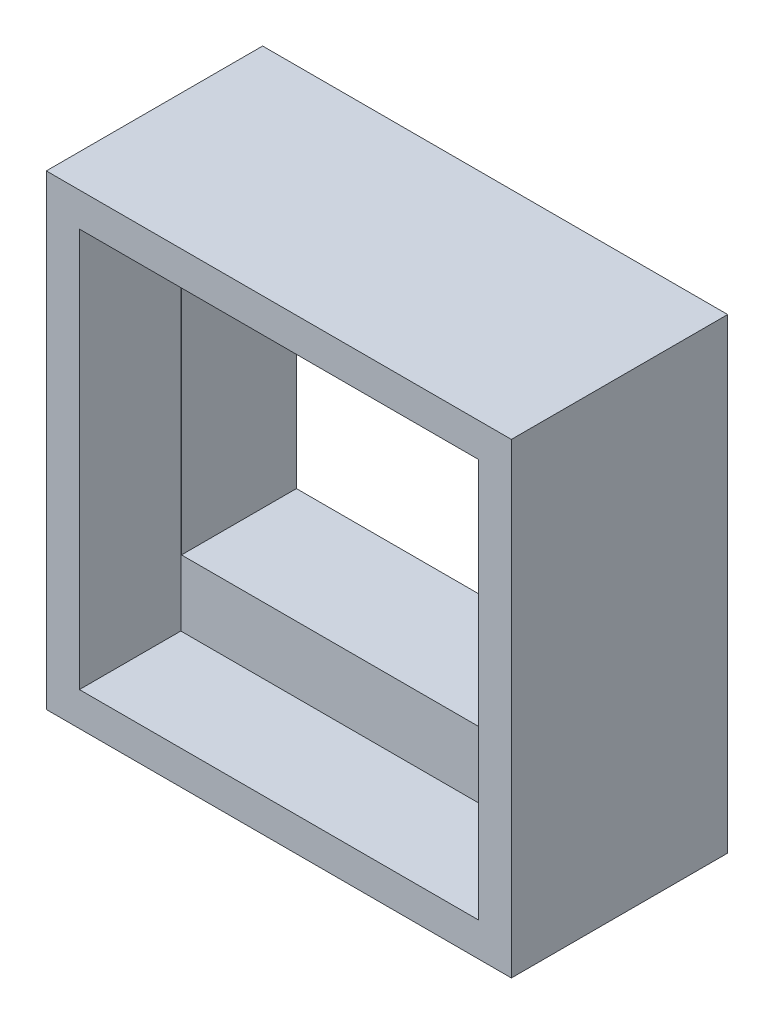
ISO-10303-21;
HEADER;
FILE_DESCRIPTION(('STEP AP214'),'2;1');
FILE_NAME('part.step','',(''),(''),'','','');
FILE_SCHEMA(('AUTOMOTIVE_DESIGN { 1 0 10303 214 1 1 1 1 }'));
ENDSEC;
DATA;
#1=APPLICATION_CONTEXT('core data for automotive mechanical design processes');
#2=APPLICATION_PROTOCOL_DEFINITION('international standard','automotive_design',2000,#1);
#3=PRODUCT_CONTEXT('',#1,'mechanical');
#4=PRODUCT('Part','Part','',(#3));
#5=PRODUCT_RELATED_PRODUCT_CATEGORY('part','',(#4));
#6=PRODUCT_DEFINITION_FORMATION('','',#4);
#7=PRODUCT_DEFINITION_CONTEXT('part definition',#1,'design');
#8=PRODUCT_DEFINITION('design','',#6,#7);
#9=PRODUCT_DEFINITION_SHAPE('','',#8);
#10=(LENGTH_UNIT() NAMED_UNIT(*) SI_UNIT(.MILLI.,.METRE.));
#11=(NAMED_UNIT(*) PLANE_ANGLE_UNIT() SI_UNIT($,.RADIAN.));
#12=(NAMED_UNIT(*) SI_UNIT($,.STERADIAN.) SOLID_ANGLE_UNIT());
#13=UNCERTAINTY_MEASURE_WITH_UNIT(LENGTH_MEASURE(1.E-05),#10,'distance_accuracy_value','');
#14=(GEOMETRIC_REPRESENTATION_CONTEXT(3) GLOBAL_UNCERTAINTY_ASSIGNED_CONTEXT((#13)) GLOBAL_UNIT_ASSIGNED_CONTEXT((#10,
#11,#12)) REPRESENTATION_CONTEXT('',''));
#15=CARTESIAN_POINT('',(0.,0.,0.));
#16=DIRECTION('',(0.,0.,1.));
#17=DIRECTION('',(1.,0.,0.));
#18=AXIS2_PLACEMENT_3D('',#15,#16,#17);
#19=CARTESIAN_POINT('',(-28.2393252100415,17.7130149812734,32.));
#20=DIRECTION('',(1.,0.,0.));
#21=DIRECTION('',(0.,1.,0.));
#22=AXIS2_PLACEMENT_3D('',#19,#20,#21);
#23=PLANE('',#22);
#24=DIRECTION('',(0.,0.,-1.));
#25=VECTOR('',#24,1.);
#26=CARTESIAN_POINT('',(-28.2393252100415,17.7130149812734,32.));
#27=LINE('',#26,#25);
#28=CARTESIAN_POINT('',(-28.2393252100415,17.7130149812734,17.));
#29=VERTEX_POINT('',#28);
#30=CARTESIAN_POINT('',(-28.2393252100415,17.7130149812734,0.));
#31=VERTEX_POINT('',#30);
#32=EDGE_CURVE('E204',#29,#31,#27,.T.);
#33=ORIENTED_EDGE('',*,*,#32,.F.);
#34=DIRECTION('',(0.,-1.,0.));
#35=VECTOR('',#34,1.);
#36=CARTESIAN_POINT('',(-28.2393252100415,17.7130149812734,17.));
#37=LINE('',#36,#35);
#38=CARTESIAN_POINT('',(-28.2393252100415,-21.6869850187266,17.));
#39=VERTEX_POINT('',#38);
#40=EDGE_CURVE('E63',#29,#39,#37,.T.);
#41=ORIENTED_EDGE('',*,*,#40,.T.);
#42=DIRECTION('',(0.,0.,-1.));
#43=VECTOR('',#42,1.);
#44=CARTESIAN_POINT('',(-28.2393252100415,-21.6869850187266,32.));
#45=LINE('',#44,#43);
#46=CARTESIAN_POINT('',(-28.2393252100415,-21.6869850187266,0.));
#47=VERTEX_POINT('',#46);
#48=EDGE_CURVE('E213',#39,#47,#45,.T.);
#49=ORIENTED_EDGE('',*,*,#48,.T.);
#50=DIRECTION('',(0.,-1.,0.));
#51=VECTOR('',#50,1.);
#52=CARTESIAN_POINT('',(-28.2393252100415,17.7130149812734,0.));
#53=LINE('',#52,#51);
#54=EDGE_CURVE('E188',#31,#47,#53,.T.);
#55=ORIENTED_EDGE('',*,*,#54,.F.);
#56=EDGE_LOOP('',(#33,#41,#49,#55));
#57=FACE_BOUND('',#56,.T.);
#58=ADVANCED_FACE('F39',(#57),#23,.T.);
#59=CARTESIAN_POINT('',(-28.2393252100415,-21.6869850187266,32.));
#60=DIRECTION('',(0.,1.,0.));
#61=DIRECTION('',(0.,0.,1.));
#62=AXIS2_PLACEMENT_3D('',#59,#60,#61);
#63=PLANE('',#62);
#64=ORIENTED_EDGE('',*,*,#48,.F.);
#65=DIRECTION('',(1.,0.,0.));
#66=VECTOR('',#65,1.);
#67=CARTESIAN_POINT('',(-28.2393252100415,-21.6869850187266,17.));
#68=LINE('',#67,#66);
#69=CARTESIAN_POINT('',(30.5606747899585,-21.6869850187266,17.));
#70=VERTEX_POINT('',#69);
#71=EDGE_CURVE('E182',#39,#70,#68,.T.);
#72=ORIENTED_EDGE('',*,*,#71,.T.);
#73=DIRECTION('',(0.,0.,-1.));
#74=VECTOR('',#73,1.);
#75=CARTESIAN_POINT('',(30.5606747899585,-21.6869850187266,32.));
#76=LINE('',#75,#74);
#77=CARTESIAN_POINT('',(30.5606747899585,-21.6869850187266,0.));
#78=VERTEX_POINT('',#77);
#79=EDGE_CURVE('E210',#70,#78,#76,.T.);
#80=ORIENTED_EDGE('',*,*,#79,.T.);
#81=DIRECTION('',(1.,0.,0.));
#82=VECTOR('',#81,1.);
#83=CARTESIAN_POINT('',(-28.2393252100415,-21.6869850187266,0.));
#84=LINE('',#83,#82);
#85=EDGE_CURVE('E192',#47,#78,#84,.T.);
#86=ORIENTED_EDGE('',*,*,#85,.F.);
#87=EDGE_LOOP('',(#64,#72,#80,#86));
#88=FACE_BOUND('',#87,.T.);
#89=ADVANCED_FACE('F291',(#88),#63,.T.);
#90=CARTESIAN_POINT('',(30.5606747899585,17.7130149812734,32.));
#91=DIRECTION('',(-1.,0.,0.));
#92=DIRECTION('',(0.,-1.,0.));
#93=AXIS2_PLACEMENT_3D('',#90,#91,#92);
#94=PLANE('',#93);
#95=ORIENTED_EDGE('',*,*,#79,.F.);
#96=DIRECTION('',(0.,1.,0.));
#97=VECTOR('',#96,1.);
#98=CARTESIAN_POINT('',(30.5606747899585,17.7130149812734,17.));
#99=LINE('',#98,#97);
#100=CARTESIAN_POINT('',(30.5606747899585,17.7130149812734,17.));
#101=VERTEX_POINT('',#100);
#102=EDGE_CURVE('E173',#70,#101,#99,.T.);
#103=ORIENTED_EDGE('',*,*,#102,.T.);
#104=DIRECTION('',(0.,0.,-1.));
#105=VECTOR('',#104,1.);
#106=CARTESIAN_POINT('',(30.5606747899585,17.7130149812734,32.));
#107=LINE('',#106,#105);
#108=CARTESIAN_POINT('',(30.5606747899585,17.7130149812734,0.));
#109=VERTEX_POINT('',#108);
#110=EDGE_CURVE('E207',#101,#109,#107,.T.);
#111=ORIENTED_EDGE('',*,*,#110,.T.);
#112=DIRECTION('',(0.,1.,0.));
#113=VECTOR('',#112,1.);
#114=CARTESIAN_POINT('',(30.5606747899585,17.7130149812734,0.));
#115=LINE('',#114,#113);
#116=EDGE_CURVE('E196',#78,#109,#115,.T.);
#117=ORIENTED_EDGE('',*,*,#116,.F.);
#118=EDGE_LOOP('',(#95,#103,#111,#117));
#119=FACE_BOUND('',#118,.T.);
#120=ADVANCED_FACE('F286',(#119),#94,.T.);
#121=CARTESIAN_POINT('',(-28.2393252100415,17.7130149812734,32.));
#122=DIRECTION('',(0.,-1.,0.));
#123=DIRECTION('',(0.,0.,-1.));
#124=AXIS2_PLACEMENT_3D('',#121,#122,#123);
#125=PLANE('',#124);
#126=ORIENTED_EDGE('',*,*,#110,.F.);
#127=DIRECTION('',(-1.,0.,0.));
#128=VECTOR('',#127,1.);
#129=CARTESIAN_POINT('',(-28.2393252100415,17.7130149812734,17.));
#130=LINE('',#129,#128);
#131=EDGE_CURVE('E11',#101,#29,#130,.T.);
#132=ORIENTED_EDGE('',*,*,#131,.T.);
#133=ORIENTED_EDGE('',*,*,#32,.T.);
#134=DIRECTION('',(-1.,0.,0.));
#135=VECTOR('',#134,1.);
#136=CARTESIAN_POINT('',(-28.2393252100415,17.7130149812734,0.));
#137=LINE('',#136,#135);
#138=EDGE_CURVE('E200',#109,#31,#137,.T.);
#139=ORIENTED_EDGE('',*,*,#138,.F.);
#140=EDGE_LOOP('',(#126,#132,#133,#139));
#141=FACE_BOUND('',#140,.T.);
#142=ADVANCED_FACE('F278',(#141),#125,.T.);
#143=CARTESIAN_POINT('',(0.,0.,32.));
#144=DIRECTION('',(0.,0.,1.));
#145=DIRECTION('',(1.,0.,0.));
#146=AXIS2_PLACEMENT_3D('',#143,#144,#145);
#147=PLANE('',#146);
#148=DIRECTION('',(0.,-1.,0.));
#149=VECTOR('',#148,1.);
#150=CARTESIAN_POINT('',(-28.3393252100415,27.5130149812734,32.));
#151=LINE('',#150,#149);
#152=CARTESIAN_POINT('',(-28.3393252100415,27.5130149812734,32.));
#153=VERTEX_POINT('',#152);
#154=CARTESIAN_POINT('',(-28.3393252100415,-31.4869850187266,32.));
#155=VERTEX_POINT('',#154);
#156=EDGE_CURVE('E55',#153,#155,#151,.T.);
#157=ORIENTED_EDGE('',*,*,#156,.F.);
#158=DIRECTION('',(-1.,0.,0.));
#159=VECTOR('',#158,1.);
#160=CARTESIAN_POINT('',(-28.3393252100415,27.5130149812734,32.));
#161=LINE('',#160,#159);
#162=CARTESIAN_POINT('',(30.6606747899585,27.5130149812734,32.));
#163=VERTEX_POINT('',#162);
#164=EDGE_CURVE('E151',#163,#153,#161,.T.);
#165=ORIENTED_EDGE('',*,*,#164,.F.);
#166=DIRECTION('',(0.,1.,0.));
#167=VECTOR('',#166,1.);
#168=CARTESIAN_POINT('',(30.6606747899585,27.5130149812734,32.));
#169=LINE('',#168,#167);
#170=CARTESIAN_POINT('',(30.6606747899585,-31.4869850187266,32.));
#171=VERTEX_POINT('',#170);
#172=EDGE_CURVE('E155',#171,#163,#169,.T.);
#173=ORIENTED_EDGE('',*,*,#172,.F.);
#174=DIRECTION('',(1.,0.,0.));
#175=VECTOR('',#174,1.);
#176=CARTESIAN_POINT('',(-28.3393252100415,-31.4869850187266,32.));
#177=LINE('',#176,#175);
#178=EDGE_CURVE('E164',#155,#171,#177,.T.);
#179=ORIENTED_EDGE('',*,*,#178,.F.);
#180=EDGE_LOOP('',(#157,#165,#173,#179));
#181=FACE_BOUND('',#180,.T.);
#182=DIRECTION('',(0.,-1.,0.));
#183=VECTOR('',#182,1.);
#184=CARTESIAN_POINT('',(-33.2393252100415,32.5130149812734,32.));
#185=LINE('',#184,#183);
#186=CARTESIAN_POINT('',(-33.2393252100415,32.5130149812734,32.));
#187=VERTEX_POINT('',#186);
#188=CARTESIAN_POINT('',(-33.2393252100415,-36.4869850187266,32.));
#189=VERTEX_POINT('',#188);
#190=EDGE_CURVE('E217',#187,#189,#185,.T.);
#191=ORIENTED_EDGE('',*,*,#190,.T.);
#192=DIRECTION('',(1.,0.,0.));
#193=VECTOR('',#192,1.);
#194=CARTESIAN_POINT('',(-33.2393252100415,-36.4869850187266,32.));
#195=LINE('',#194,#193);
#196=CARTESIAN_POINT('',(35.5606747899585,-36.4869850187266,32.));
#197=VERTEX_POINT('',#196);
#198=EDGE_CURVE('E221',#189,#197,#195,.T.);
#199=ORIENTED_EDGE('',*,*,#198,.T.);
#200=DIRECTION('',(0.,1.,0.));
#201=VECTOR('',#200,1.);
#202=CARTESIAN_POINT('',(35.5606747899585,32.5130149812734,32.));
#203=LINE('',#202,#201);
#204=CARTESIAN_POINT('',(35.5606747899585,32.5130149812734,32.));
#205=VERTEX_POINT('',#204);
#206=EDGE_CURVE('E225',#197,#205,#203,.T.);
#207=ORIENTED_EDGE('',*,*,#206,.T.);
#208=DIRECTION('',(-1.,0.,0.));
#209=VECTOR('',#208,1.);
#210=CARTESIAN_POINT('',(-33.2393252100415,32.5130149812734,32.));
#211=LINE('',#210,#209);
#212=EDGE_CURVE('E228',#205,#187,#211,.T.);
#213=ORIENTED_EDGE('',*,*,#212,.T.);
#214=EDGE_LOOP('',(#191,#199,#207,#213));
#215=FACE_BOUND('',#214,.T.);
#216=ADVANCED_FACE('F276',(#181,#215),#147,.T.);
#217=CARTESIAN_POINT('',(0.,0.,0.));
#218=DIRECTION('',(0.,0.,1.));
#219=DIRECTION('',(1.,0.,0.));
#220=AXIS2_PLACEMENT_3D('',#217,#218,#219);
#221=PLANE('',#220);
#222=DIRECTION('',(0.,-1.,0.));
#223=VECTOR('',#222,1.);
#224=CARTESIAN_POINT('',(-33.2393252100415,32.5130149812734,0.));
#225=LINE('',#224,#223);
#226=CARTESIAN_POINT('',(-33.2393252100415,32.5130149812734,0.));
#227=VERTEX_POINT('',#226);
#228=CARTESIAN_POINT('',(-33.2393252100415,-36.4869850187266,0.));
#229=VERTEX_POINT('',#228);
#230=EDGE_CURVE('E216',#227,#229,#225,.T.);
#231=ORIENTED_EDGE('',*,*,#230,.F.);
#232=DIRECTION('',(-1.,0.,0.));
#233=VECTOR('',#232,1.);
#234=CARTESIAN_POINT('',(-33.2393252100415,32.5130149812734,0.));
#235=LINE('',#234,#233);
#236=CARTESIAN_POINT('',(35.5606747899585,32.5130149812734,0.));
#237=VERTEX_POINT('',#236);
#238=EDGE_CURVE('E222',#237,#227,#235,.T.);
#239=ORIENTED_EDGE('',*,*,#238,.F.);
#240=DIRECTION('',(0.,1.,0.));
#241=VECTOR('',#240,1.);
#242=CARTESIAN_POINT('',(35.5606747899585,32.5130149812734,0.));
#243=LINE('',#242,#241);
#244=CARTESIAN_POINT('',(35.5606747899585,-36.4869850187266,0.));
#245=VERTEX_POINT('',#244);
#246=EDGE_CURVE('E238',#245,#237,#243,.T.);
#247=ORIENTED_EDGE('',*,*,#246,.F.);
#248=DIRECTION('',(1.,0.,0.));
#249=VECTOR('',#248,1.);
#250=CARTESIAN_POINT('',(-33.2393252100415,-36.4869850187266,0.));
#251=LINE('',#250,#249);
#252=EDGE_CURVE('E235',#229,#245,#251,.T.);
#253=ORIENTED_EDGE('',*,*,#252,.F.);
#254=EDGE_LOOP('',(#231,#239,#247,#253));
#255=FACE_BOUND('',#254,.T.);
#256=ORIENTED_EDGE('',*,*,#54,.T.);
#257=ORIENTED_EDGE('',*,*,#85,.T.);
#258=ORIENTED_EDGE('',*,*,#116,.T.);
#259=ORIENTED_EDGE('',*,*,#138,.T.);
#260=EDGE_LOOP('',(#256,#257,#258,#259));
#261=FACE_BOUND('',#260,.T.);
#262=ADVANCED_FACE('F265',(#255,#261),#221,.F.);
#263=CARTESIAN_POINT('',(-33.2393252100415,32.5130149812734,32.));
#264=DIRECTION('',(1.,0.,0.));
#265=DIRECTION('',(0.,0.,-1.));
#266=AXIS2_PLACEMENT_3D('',#263,#264,#265);
#267=PLANE('',#266);
#268=ORIENTED_EDGE('',*,*,#230,.T.);
#269=DIRECTION('',(0.,0.,-1.));
#270=VECTOR('',#269,1.);
#271=CARTESIAN_POINT('',(-33.2393252100415,-36.4869850187266,32.));
#272=LINE('',#271,#270);
#273=EDGE_CURVE('E48',#189,#229,#272,.T.);
#274=ORIENTED_EDGE('',*,*,#273,.F.);
#275=ORIENTED_EDGE('',*,*,#190,.F.);
#276=DIRECTION('',(0.,0.,-1.));
#277=VECTOR('',#276,1.);
#278=CARTESIAN_POINT('',(-33.2393252100415,32.5130149812734,32.));
#279=LINE('',#278,#277);
#280=EDGE_CURVE('E231',#187,#227,#279,.T.);
#281=ORIENTED_EDGE('',*,*,#280,.T.);
#282=EDGE_LOOP('',(#268,#274,#275,#281));
#283=FACE_BOUND('',#282,.T.);
#284=ADVANCED_FACE('F41',(#283),#267,.F.);
#285=CARTESIAN_POINT('',(-33.2393252100415,-36.4869850187266,32.));
#286=DIRECTION('',(0.,1.,0.));
#287=DIRECTION('',(0.,0.,1.));
#288=AXIS2_PLACEMENT_3D('',#285,#286,#287);
#289=PLANE('',#288);
#290=ORIENTED_EDGE('',*,*,#252,.T.);
#291=DIRECTION('',(0.,0.,-1.));
#292=VECTOR('',#291,1.);
#293=CARTESIAN_POINT('',(35.5606747899585,-36.4869850187266,32.));
#294=LINE('',#293,#292);
#295=EDGE_CURVE('E250',#197,#245,#294,.T.);
#296=ORIENTED_EDGE('',*,*,#295,.F.);
#297=ORIENTED_EDGE('',*,*,#198,.F.);
#298=ORIENTED_EDGE('',*,*,#273,.T.);
#299=EDGE_LOOP('',(#290,#296,#297,#298));
#300=FACE_BOUND('',#299,.T.);
#301=ADVANCED_FACE('F257',(#300),#289,.F.);
#302=CARTESIAN_POINT('',(35.5606747899585,32.5130149812734,32.));
#303=DIRECTION('',(-1.,0.,0.));
#304=DIRECTION('',(0.,-1.,0.));
#305=AXIS2_PLACEMENT_3D('',#302,#303,#304);
#306=PLANE('',#305);
#307=ORIENTED_EDGE('',*,*,#246,.T.);
#308=DIRECTION('',(0.,0.,-1.));
#309=VECTOR('',#308,1.);
#310=CARTESIAN_POINT('',(35.5606747899585,32.5130149812734,32.));
#311=LINE('',#310,#309);
#312=EDGE_CURVE('E246',#205,#237,#311,.T.);
#313=ORIENTED_EDGE('',*,*,#312,.F.);
#314=ORIENTED_EDGE('',*,*,#206,.F.);
#315=ORIENTED_EDGE('',*,*,#295,.T.);
#316=EDGE_LOOP('',(#307,#313,#314,#315));
#317=FACE_BOUND('',#316,.T.);
#318=ADVANCED_FACE('F270',(#317),#306,.F.);
#319=CARTESIAN_POINT('',(-33.2393252100415,32.5130149812734,32.));
#320=DIRECTION('',(0.,-1.,0.));
#321=DIRECTION('',(0.,0.,-1.));
#322=AXIS2_PLACEMENT_3D('',#319,#320,#321);
#323=PLANE('',#322);
#324=ORIENTED_EDGE('',*,*,#238,.T.);
#325=ORIENTED_EDGE('',*,*,#280,.F.);
#326=ORIENTED_EDGE('',*,*,#212,.F.);
#327=ORIENTED_EDGE('',*,*,#312,.T.);
#328=EDGE_LOOP('',(#324,#325,#326,#327));
#329=FACE_BOUND('',#328,.T.);
#330=ADVANCED_FACE('F274',(#329),#323,.F.);
#331=CARTESIAN_POINT('',(-28.3393252100415,27.5130149812734,17.));
#332=DIRECTION('',(-1.,0.,0.));
#333=DIRECTION('',(0.,-1.,0.));
#334=AXIS2_PLACEMENT_3D('',#331,#332,#333);
#335=PLANE('',#334);
#336=ORIENTED_EDGE('',*,*,#156,.T.);
#337=DIRECTION('',(0.,0.,1.));
#338=VECTOR('',#337,1.);
#339=CARTESIAN_POINT('',(-28.3393252100415,-31.4869850187266,17.));
#340=LINE('',#339,#338);
#341=CARTESIAN_POINT('',(-28.3393252100415,-31.4869850187266,17.));
#342=VERTEX_POINT('',#341);
#343=EDGE_CURVE('E126',#342,#155,#340,.T.);
#344=ORIENTED_EDGE('',*,*,#343,.F.);
#345=DIRECTION('',(0.,-1.,0.));
#346=VECTOR('',#345,1.);
#347=CARTESIAN_POINT('',(-28.3393252100415,27.5130149812734,17.));
#348=LINE('',#347,#346);
#349=CARTESIAN_POINT('',(-28.3393252100415,27.5130149812734,17.));
#350=VERTEX_POINT('',#349);
#351=EDGE_CURVE('E130',#350,#342,#348,.T.);
#352=ORIENTED_EDGE('',*,*,#351,.F.);
#353=DIRECTION('',(0.,0.,1.));
#354=VECTOR('',#353,1.);
#355=CARTESIAN_POINT('',(-28.3393252100415,27.5130149812734,17.));
#356=LINE('',#355,#354);
#357=EDGE_CURVE('E170',#350,#153,#356,.T.);
#358=ORIENTED_EDGE('',*,*,#357,.T.);
#359=EDGE_LOOP('',(#336,#344,#352,#358));
#360=FACE_BOUND('',#359,.T.);
#361=ADVANCED_FACE('F128',(#360),#335,.F.);
#362=CARTESIAN_POINT('',(-28.3393252100415,27.5130149812734,17.));
#363=DIRECTION('',(0.,1.,0.));
#364=DIRECTION('',(0.,0.,1.));
#365=AXIS2_PLACEMENT_3D('',#362,#363,#364);
#366=PLANE('',#365);
#367=ORIENTED_EDGE('',*,*,#164,.T.);
#368=ORIENTED_EDGE('',*,*,#357,.F.);
#369=DIRECTION('',(-1.,0.,0.));
#370=VECTOR('',#369,1.);
#371=CARTESIAN_POINT('',(-28.3393252100415,27.5130149812734,17.));
#372=LINE('',#371,#370);
#373=CARTESIAN_POINT('',(30.6606747899585,27.5130149812734,17.));
#374=VERTEX_POINT('',#373);
#375=EDGE_CURVE('E137',#374,#350,#372,.T.);
#376=ORIENTED_EDGE('',*,*,#375,.F.);
#377=DIRECTION('',(0.,0.,1.));
#378=VECTOR('',#377,1.);
#379=CARTESIAN_POINT('',(30.6606747899585,27.5130149812734,17.));
#380=LINE('',#379,#378);
#381=EDGE_CURVE('E174',#374,#163,#380,.T.);
#382=ORIENTED_EDGE('',*,*,#381,.T.);
#383=EDGE_LOOP('',(#367,#368,#376,#382));
#384=FACE_BOUND('',#383,.T.);
#385=ADVANCED_FACE('F305',(#384),#366,.F.);
#386=CARTESIAN_POINT('',(30.6606747899585,27.5130149812734,17.));
#387=DIRECTION('',(1.,0.,0.));
#388=DIRECTION('',(0.,1.,0.));
#389=AXIS2_PLACEMENT_3D('',#386,#387,#388);
#390=PLANE('',#389);
#391=ORIENTED_EDGE('',*,*,#172,.T.);
#392=ORIENTED_EDGE('',*,*,#381,.F.);
#393=DIRECTION('',(0.,1.,0.));
#394=VECTOR('',#393,1.);
#395=CARTESIAN_POINT('',(30.6606747899585,27.5130149812734,17.));
#396=LINE('',#395,#394);
#397=CARTESIAN_POINT('',(30.6606747899585,-31.4869850187266,17.));
#398=VERTEX_POINT('',#397);
#399=EDGE_CURVE('E146',#398,#374,#396,.T.);
#400=ORIENTED_EDGE('',*,*,#399,.F.);
#401=DIRECTION('',(0.,0.,1.));
#402=VECTOR('',#401,1.);
#403=CARTESIAN_POINT('',(30.6606747899585,-31.4869850187266,17.));
#404=LINE('',#403,#402);
#405=EDGE_CURVE('E136',#398,#171,#404,.T.);
#406=ORIENTED_EDGE('',*,*,#405,.T.);
#407=EDGE_LOOP('',(#391,#392,#400,#406));
#408=FACE_BOUND('',#407,.T.);
#409=ADVANCED_FACE('F308',(#408),#390,.F.);
#410=CARTESIAN_POINT('',(-28.3393252100415,-31.4869850187266,17.));
#411=DIRECTION('',(0.,-1.,0.));
#412=DIRECTION('',(0.,0.,-1.));
#413=AXIS2_PLACEMENT_3D('',#410,#411,#412);
#414=PLANE('',#413);
#415=ORIENTED_EDGE('',*,*,#178,.T.);
#416=ORIENTED_EDGE('',*,*,#405,.F.);
#417=DIRECTION('',(1.,0.,0.));
#418=VECTOR('',#417,1.);
#419=CARTESIAN_POINT('',(-28.3393252100415,-31.4869850187266,17.));
#420=LINE('',#419,#418);
#421=EDGE_CURVE('E140',#342,#398,#420,.T.);
#422=ORIENTED_EDGE('',*,*,#421,.F.);
#423=ORIENTED_EDGE('',*,*,#343,.T.);
#424=EDGE_LOOP('',(#415,#416,#422,#423));
#425=FACE_BOUND('',#424,.T.);
#426=ADVANCED_FACE('F141',(#425),#414,.F.);
#427=CARTESIAN_POINT('',(0.,0.,17.));
#428=DIRECTION('',(0.,0.,1.));
#429=DIRECTION('',(1.,0.,0.));
#430=AXIS2_PLACEMENT_3D('',#427,#428,#429);
#431=PLANE('',#430);
#432=ORIENTED_EDGE('',*,*,#131,.F.);
#433=ORIENTED_EDGE('',*,*,#102,.F.);
#434=ORIENTED_EDGE('',*,*,#71,.F.);
#435=ORIENTED_EDGE('',*,*,#40,.F.);
#436=EDGE_LOOP('',(#432,#433,#434,#435));
#437=FACE_BOUND('',#436,.T.);
#438=ORIENTED_EDGE('',*,*,#351,.T.);
#439=ORIENTED_EDGE('',*,*,#421,.T.);
#440=ORIENTED_EDGE('',*,*,#399,.T.);
#441=ORIENTED_EDGE('',*,*,#375,.T.);
#442=EDGE_LOOP('',(#438,#439,#440,#441));
#443=FACE_BOUND('',#442,.T.);
#444=ADVANCED_FACE('F148',(#437,#443),#431,.T.);
#445=CLOSED_SHELL('',(#58,#89,#120,#142,#216,#262,#284,#301,#318,#330,#361,#385,#409,#426,#444));
#446=MANIFOLD_SOLID_BREP('B2',#445);
#447=ADVANCED_BREP_SHAPE_REPRESENTATION('',(#18,#446),#14);
#448=SHAPE_DEFINITION_REPRESENTATION(#9,#447);
ENDSEC;
END-ISO-10303-21;
